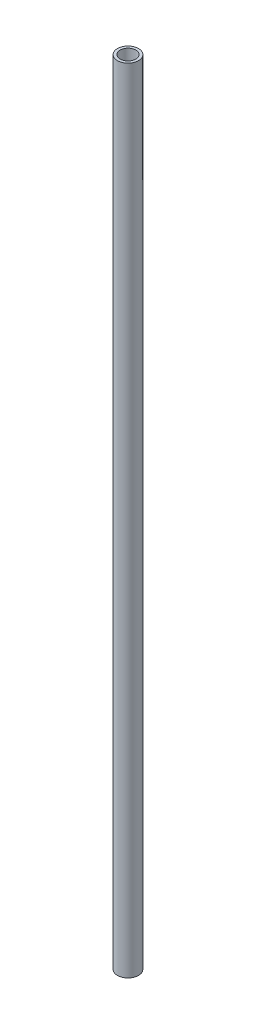
ISO-10303-21;
HEADER;
FILE_DESCRIPTION(('STEP AP214'),'2;1');
FILE_NAME('part.step','',(''),(''),'','','');
FILE_SCHEMA(('AUTOMOTIVE_DESIGN { 1 0 10303 214 1 1 1 1 }'));
ENDSEC;
DATA;
#1=APPLICATION_CONTEXT('core data for automotive mechanical design processes');
#2=APPLICATION_PROTOCOL_DEFINITION('international standard','automotive_design',2000,#1);
#3=PRODUCT_CONTEXT('',#1,'mechanical');
#4=PRODUCT('Part','Part','',(#3));
#5=PRODUCT_RELATED_PRODUCT_CATEGORY('part','',(#4));
#6=PRODUCT_DEFINITION_FORMATION('','',#4);
#7=PRODUCT_DEFINITION_CONTEXT('part definition',#1,'design');
#8=PRODUCT_DEFINITION('design','',#6,#7);
#9=PRODUCT_DEFINITION_SHAPE('','',#8);
#10=(LENGTH_UNIT() NAMED_UNIT(*) SI_UNIT(.MILLI.,.METRE.));
#11=(NAMED_UNIT(*) PLANE_ANGLE_UNIT() SI_UNIT($,.RADIAN.));
#12=(NAMED_UNIT(*) SI_UNIT($,.STERADIAN.) SOLID_ANGLE_UNIT());
#13=UNCERTAINTY_MEASURE_WITH_UNIT(LENGTH_MEASURE(1.E-05),#10,'distance_accuracy_value','');
#14=(GEOMETRIC_REPRESENTATION_CONTEXT(3) GLOBAL_UNCERTAINTY_ASSIGNED_CONTEXT((#13)) GLOBAL_UNIT_ASSIGNED_CONTEXT((#10,
#11,#12)) REPRESENTATION_CONTEXT('',''));
#15=CARTESIAN_POINT('',(0.,0.,0.));
#16=DIRECTION('',(0.,0.,1.));
#17=DIRECTION('',(1.,0.,0.));
#18=AXIS2_PLACEMENT_3D('',#15,#16,#17);
#19=CARTESIAN_POINT('',(0.,75.5,0.));
#20=DIRECTION('',(0.,1.,0.));
#21=DIRECTION('',(0.,0.,1.));
#22=AXIS2_PLACEMENT_3D('',#19,#20,#21);
#23=PLANE('',#22);
#24=CARTESIAN_POINT('',(0.,75.5,0.));
#25=DIRECTION('',(0.,1.,0.));
#26=DIRECTION('',(0.,0.,1.));
#27=AXIS2_PLACEMENT_3D('',#24,#25,#26);
#28=CIRCLE('',#27,2.);
#29=CARTESIAN_POINT('',(0.,75.5,2.));
#30=VERTEX_POINT('',#29);
#31=EDGE_CURVE('E10',#30,#30,#28,.T.);
#32=ORIENTED_EDGE('',*,*,#31,.T.);
#33=EDGE_LOOP('',(#32));
#34=FACE_BOUND('',#33,.T.);
#35=CARTESIAN_POINT('',(0.,75.5,0.));
#36=DIRECTION('',(0.,1.,0.));
#37=DIRECTION('',(0.,0.,1.));
#38=AXIS2_PLACEMENT_3D('',#35,#36,#37);
#39=CIRCLE('',#38,1.5);
#40=CARTESIAN_POINT('',(0.,75.5,1.5));
#41=VERTEX_POINT('',#40);
#42=EDGE_CURVE('E48',#41,#41,#39,.T.);
#43=ORIENTED_EDGE('',*,*,#42,.F.);
#44=EDGE_LOOP('',(#43));
#45=FACE_BOUND('',#44,.T.);
#46=ADVANCED_FACE('F37',(#34,#45),#23,.T.);
#47=CARTESIAN_POINT('',(0.,-75.5,0.));
#48=DIRECTION('',(0.,1.,0.));
#49=DIRECTION('',(0.,0.,1.));
#50=AXIS2_PLACEMENT_3D('',#47,#48,#49);
#51=PLANE('',#50);
#52=CARTESIAN_POINT('',(0.,-75.5,0.));
#53=DIRECTION('',(0.,1.,0.));
#54=DIRECTION('',(0.,0.,1.));
#55=AXIS2_PLACEMENT_3D('',#52,#53,#54);
#56=CIRCLE('',#55,2.);
#57=CARTESIAN_POINT('',(0.,-75.5,2.));
#58=VERTEX_POINT('',#57);
#59=EDGE_CURVE('E41',#58,#58,#56,.T.);
#60=ORIENTED_EDGE('',*,*,#59,.F.);
#61=EDGE_LOOP('',(#60));
#62=FACE_BOUND('',#61,.T.);
#63=CARTESIAN_POINT('',(0.,-75.5,0.));
#64=DIRECTION('',(0.,1.,0.));
#65=DIRECTION('',(0.,0.,1.));
#66=AXIS2_PLACEMENT_3D('',#63,#64,#65);
#67=CIRCLE('',#66,1.5);
#68=CARTESIAN_POINT('',(0.,-75.5,1.5));
#69=VERTEX_POINT('',#68);
#70=EDGE_CURVE('E50',#69,#69,#67,.T.);
#71=ORIENTED_EDGE('',*,*,#70,.T.);
#72=EDGE_LOOP('',(#71));
#73=FACE_BOUND('',#72,.T.);
#74=ADVANCED_FACE('F60',(#62,#73),#51,.F.);
#75=CARTESIAN_POINT('',(0.,75.5,0.));
#76=DIRECTION('',(0.,-1.,0.));
#77=DIRECTION('',(0.,0.,-1.));
#78=AXIS2_PLACEMENT_3D('',#75,#76,#77);
#79=CYLINDRICAL_SURFACE('',#78,2.);
#80=ORIENTED_EDGE('',*,*,#31,.F.);
#81=EDGE_LOOP('',(#80));
#82=FACE_BOUND('',#81,.T.);
#83=ORIENTED_EDGE('',*,*,#59,.T.);
#84=EDGE_LOOP('',(#83));
#85=FACE_BOUND('',#84,.T.);
#86=ADVANCED_FACE('F39',(#82,#85),#79,.T.);
#87=CARTESIAN_POINT('',(0.,75.5,0.));
#88=DIRECTION('',(0.,-1.,0.));
#89=DIRECTION('',(0.,0.,-1.));
#90=AXIS2_PLACEMENT_3D('',#87,#88,#89);
#91=CYLINDRICAL_SURFACE('',#90,1.5);
#92=ORIENTED_EDGE('',*,*,#42,.T.);
#93=EDGE_LOOP('',(#92));
#94=FACE_BOUND('',#93,.T.);
#95=ORIENTED_EDGE('',*,*,#70,.F.);
#96=EDGE_LOOP('',(#95));
#97=FACE_BOUND('',#96,.T.);
#98=ADVANCED_FACE('F56',(#94,#97),#91,.F.);
#99=CLOSED_SHELL('',(#46,#74,#86,#98));
#100=MANIFOLD_SOLID_BREP('B2',#99);
#101=ADVANCED_BREP_SHAPE_REPRESENTATION('',(#18,#100),#14);
#102=SHAPE_DEFINITION_REPRESENTATION(#9,#101);
ENDSEC;
END-ISO-10303-21;
